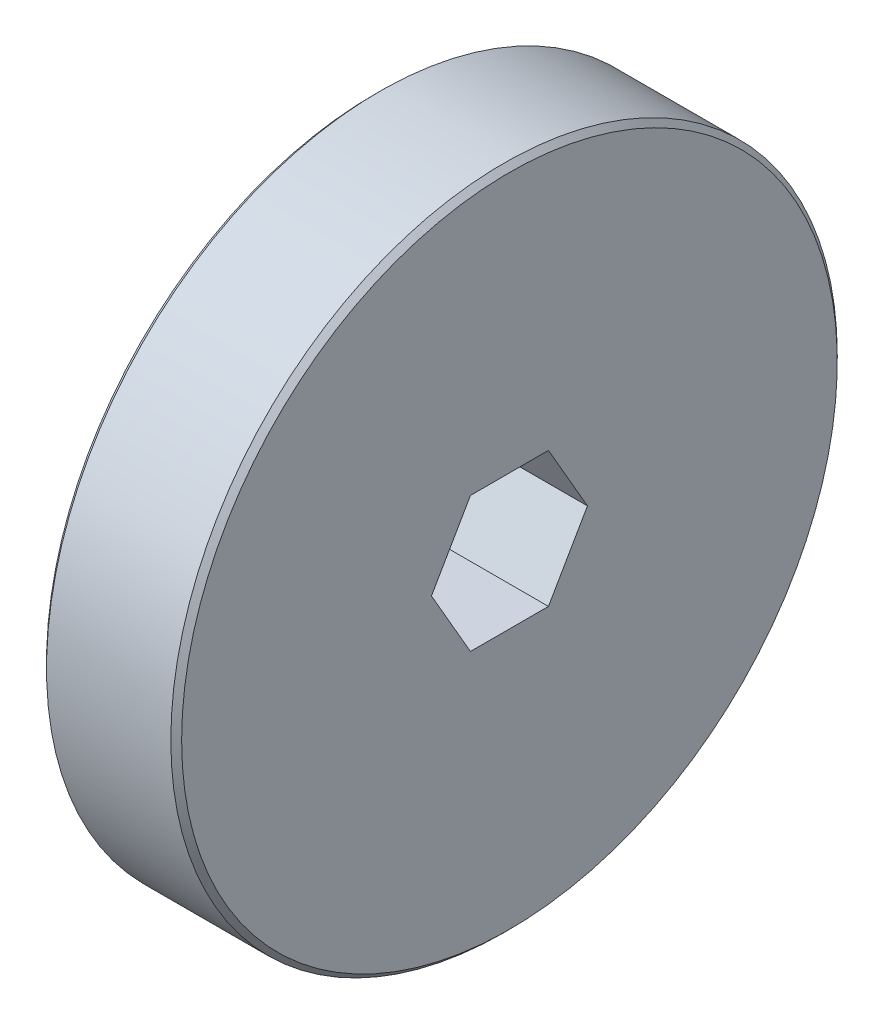
ISO-10303-21;
HEADER;
FILE_DESCRIPTION(('STEP AP214'),'2;1');
FILE_NAME('part.step','',(''),(''),'','','');
FILE_SCHEMA(('AUTOMOTIVE_DESIGN { 1 0 10303 214 1 1 1 1 }'));
ENDSEC;
DATA;
#1=APPLICATION_CONTEXT('core data for automotive mechanical design processes');
#2=APPLICATION_PROTOCOL_DEFINITION('international standard','automotive_design',2000,#1);
#3=PRODUCT_CONTEXT('',#1,'mechanical');
#4=PRODUCT('Part','Part','',(#3));
#5=PRODUCT_RELATED_PRODUCT_CATEGORY('part','',(#4));
#6=PRODUCT_DEFINITION_FORMATION('','',#4);
#7=PRODUCT_DEFINITION_CONTEXT('part definition',#1,'design');
#8=PRODUCT_DEFINITION('design','',#6,#7);
#9=PRODUCT_DEFINITION_SHAPE('','',#8);
#10=(LENGTH_UNIT() NAMED_UNIT(*) SI_UNIT(.MILLI.,.METRE.));
#11=(NAMED_UNIT(*) PLANE_ANGLE_UNIT() SI_UNIT($,.RADIAN.));
#12=(NAMED_UNIT(*) SI_UNIT($,.STERADIAN.) SOLID_ANGLE_UNIT());
#13=UNCERTAINTY_MEASURE_WITH_UNIT(LENGTH_MEASURE(1.E-05),#10,'distance_accuracy_value','');
#14=(GEOMETRIC_REPRESENTATION_CONTEXT(3) GLOBAL_UNCERTAINTY_ASSIGNED_CONTEXT((#13)) GLOBAL_UNIT_ASSIGNED_CONTEXT((#10,
#11,#12)) REPRESENTATION_CONTEXT('',''));
#15=CARTESIAN_POINT('',(0.,0.,0.));
#16=DIRECTION('',(0.,0.,1.));
#17=DIRECTION('',(1.,0.,0.));
#18=AXIS2_PLACEMENT_3D('',#15,#16,#17);
#19=CARTESIAN_POINT('',(814.404078421065,288.105971524835,0.));
#20=DIRECTION('',(1.,0.,0.));
#21=DIRECTION('',(0.,1.,0.));
#22=AXIS2_PLACEMENT_3D('',#19,#20,#21);
#23=TOROIDAL_SURFACE('',#22,8.19149999999989,0.254000000000069);
#24=CARTESIAN_POINT('',(814.658078421065,288.105971524835,0.));
#25=DIRECTION('',(1.,0.,0.));
#26=DIRECTION('',(0.,1.,0.));
#27=AXIS2_PLACEMENT_3D('',#24,#25,#26);
#28=CIRCLE('',#27,8.19150000000002);
#29=CARTESIAN_POINT('',(814.658078421065,296.297471524835,0.));
#30=VERTEX_POINT('',#29);
#31=EDGE_CURVE('E20',#30,#30,#28,.T.);
#32=ORIENTED_EDGE('',*,*,#31,.F.);
#33=EDGE_LOOP('',(#32));
#34=FACE_BOUND('',#33,.T.);
#35=CARTESIAN_POINT('',(814.404078421065,288.105971524835,0.));
#36=DIRECTION('',(1.,0.,0.));
#37=DIRECTION('',(0.,0.,-1.));
#38=AXIS2_PLACEMENT_3D('',#35,#36,#37);
#39=CIRCLE('',#38,7.9375);
#40=CARTESIAN_POINT('',(814.404078421065,288.105971524835,-7.9375));
#41=VERTEX_POINT('',#40);
#42=EDGE_CURVE('E156',#41,#41,#39,.F.);
#43=ORIENTED_EDGE('',*,*,#42,.F.);
#44=EDGE_LOOP('',(#43));
#45=FACE_BOUND('',#44,.T.);
#46=ADVANCED_FACE('F17',(#34,#45),#23,.F.);
#47=CARTESIAN_POINT('',(814.340578421065,288.105971524835,0.));
#48=DIRECTION('',(1.,0.,0.));
#49=DIRECTION('',(0.,0.,-1.));
#50=AXIS2_PLACEMENT_3D('',#47,#48,#49);
#51=CYLINDRICAL_SURFACE('',#50,7.9375);
#52=ORIENTED_EDGE('',*,*,#42,.T.);
#53=EDGE_LOOP('',(#52));
#54=FACE_BOUND('',#53,.T.);
#55=CARTESIAN_POINT('',(814.277078421179,288.105971524835,0.));
#56=DIRECTION('',(1.,0.,0.));
#57=DIRECTION('',(0.,-1.,0.));
#58=AXIS2_PLACEMENT_3D('',#55,#56,#57);
#59=CIRCLE('',#58,7.93749999988602);
#60=CARTESIAN_POINT('',(814.277078421179,280.168471524949,0.));
#61=VERTEX_POINT('',#60);
#62=EDGE_CURVE('E150',#61,#61,#59,.F.);
#63=ORIENTED_EDGE('',*,*,#62,.F.);
#64=EDGE_LOOP('',(#63));
#65=FACE_BOUND('',#64,.T.);
#66=ADVANCED_FACE('F335',(#54,#65),#51,.T.);
#67=CARTESIAN_POINT('',(814.658078421065,303.822221524835,0.));
#68=DIRECTION('',(-1.,0.,0.));
#69=DIRECTION('',(0.,0.,1.));
#70=AXIS2_PLACEMENT_3D('',#67,#68,#69);
#71=PLANE('',#70);
#72=ORIENTED_EDGE('',*,*,#31,.T.);
#73=EDGE_LOOP('',(#72));
#74=FACE_BOUND('',#73,.T.);
#75=CARTESIAN_POINT('',(814.658078420894,288.105971524835,0.));
#76=DIRECTION('',(1.,0.,0.));
#77=DIRECTION('',(0.,0.,-1.));
#78=AXIS2_PLACEMENT_3D('',#75,#76,#77);
#79=CIRCLE('',#78,23.114000000171);
#80=CARTESIAN_POINT('',(814.658078420894,288.105971524835,-23.114000000171));
#81=VERTEX_POINT('',#80);
#82=EDGE_CURVE('E153',#81,#81,#79,.T.);
#83=ORIENTED_EDGE('',*,*,#82,.F.);
#84=EDGE_LOOP('',(#83));
#85=FACE_BOUND('',#84,.T.);
#86=ADVANCED_FACE('F326',(#74,#85),#71,.T.);
#87=CARTESIAN_POINT('',(814.277078421179,288.105971524835,0.));
#88=DIRECTION('',(1.,0.,0.));
#89=DIRECTION('',(0.,0.,-1.));
#90=AXIS2_PLACEMENT_3D('',#87,#88,#89);
#91=CONICAL_SURFACE('',#90,7.93749999988602,0.785398162499982);
#92=ORIENTED_EDGE('',*,*,#62,.T.);
#93=EDGE_LOOP('',(#92));
#94=FACE_BOUND('',#93,.T.);
#95=CARTESIAN_POINT('',(814.023078420951,288.105971524835,0.));
#96=DIRECTION('',(1.,0.,0.));
#97=DIRECTION('',(0.,0.,-1.));
#98=AXIS2_PLACEMENT_3D('',#95,#96,#97);
#99=CIRCLE('',#98,7.68350000011392);
#100=CARTESIAN_POINT('',(814.023078420951,288.105971524835,-7.68350000011392));
#101=VERTEX_POINT('',#100);
#102=EDGE_CURVE('E147',#101,#101,#99,.F.);
#103=ORIENTED_EDGE('',*,*,#102,.F.);
#104=EDGE_LOOP('',(#103));
#105=FACE_BOUND('',#104,.T.);
#106=ADVANCED_FACE('F317',(#94,#105),#91,.T.);
#107=CARTESIAN_POINT('',(815.039078421236,288.105971524835,0.));
#108=DIRECTION('',(1.,0.,0.));
#109=DIRECTION('',(0.,0.,-1.));
#110=AXIS2_PLACEMENT_3D('',#107,#108,#109);
#111=CONICAL_SURFACE('',#110,23.4949999998291,0.785398162500018);
#112=CARTESIAN_POINT('',(815.039078421065,288.105971524835,0.));
#113=DIRECTION('',(1.,0.,0.));
#114=DIRECTION('',(0.,0.,-1.));
#115=AXIS2_PLACEMENT_3D('',#112,#113,#114);
#116=CIRCLE('',#115,23.495);
#117=CARTESIAN_POINT('',(815.039078421065,288.105971524835,-23.495));
#118=VERTEX_POINT('',#117);
#119=EDGE_CURVE('E144',#118,#118,#116,.T.);
#120=ORIENTED_EDGE('',*,*,#119,.F.);
#121=EDGE_LOOP('',(#120));
#122=FACE_BOUND('',#121,.T.);
#123=ORIENTED_EDGE('',*,*,#82,.T.);
#124=EDGE_LOOP('',(#123));
#125=FACE_BOUND('',#124,.T.);
#126=ADVANCED_FACE('F308',(#122,#125),#111,.T.);
#127=CARTESIAN_POINT('',(814.023078421065,292.074721524835,0.));
#128=DIRECTION('',(-1.,0.,0.));
#129=DIRECTION('',(0.,0.,1.));
#130=AXIS2_PLACEMENT_3D('',#127,#128,#129);
#131=PLANE('',#130);
#132=CARTESIAN_POINT('',(814.023078420746,288.105971524835,0.));
#133=DIRECTION('',(-1.,0.,0.));
#134=DIRECTION('',(0.,0.,1.));
#135=AXIS2_PLACEMENT_3D('',#132,#133,#134);
#136=CIRCLE('',#135,5.52449999974425);
#137=CARTESIAN_POINT('',(814.023078420746,288.105971524835,5.52449999974425));
#138=VERTEX_POINT('',#137);
#139=EDGE_CURVE('E116',#138,#138,#136,.F.);
#140=ORIENTED_EDGE('',*,*,#139,.T.);
#141=EDGE_LOOP('',(#140));
#142=FACE_BOUND('',#141,.T.);
#143=ORIENTED_EDGE('',*,*,#102,.T.);
#144=EDGE_LOOP('',(#143));
#145=FACE_BOUND('',#144,.T.);
#146=ADVANCED_FACE('F300',(#142,#145),#131,.T.);
#147=CARTESIAN_POINT('',(819.420578421065,288.105971524835,0.));
#148=DIRECTION('',(1.,0.,0.));
#149=DIRECTION('',(0.,0.,-1.));
#150=AXIS2_PLACEMENT_3D('',#147,#148,#149);
#151=CYLINDRICAL_SURFACE('',#150,23.495);
#152=CARTESIAN_POINT('',(823.802078420894,288.105971524835,0.));
#153=DIRECTION('',(-1.,0.,0.));
#154=DIRECTION('',(0.,-1.,0.));
#155=AXIS2_PLACEMENT_3D('',#152,#153,#154);
#156=CIRCLE('',#155,23.494999999829);
#157=CARTESIAN_POINT('',(823.802078420894,264.610971525006,0.));
#158=VERTEX_POINT('',#157);
#159=EDGE_CURVE('E83',#158,#158,#156,.F.);
#160=ORIENTED_EDGE('',*,*,#159,.F.);
#161=EDGE_LOOP('',(#160));
#162=FACE_BOUND('',#161,.T.);
#163=ORIENTED_EDGE('',*,*,#119,.T.);
#164=EDGE_LOOP('',(#163));
#165=FACE_BOUND('',#164,.T.);
#166=ADVANCED_FACE('F222',(#162,#165),#151,.T.);
#167=CARTESIAN_POINT('',(814.023078420803,288.105971524835,0.));
#168=DIRECTION('',(-1.,0.,0.));
#169=DIRECTION('',(0.,0.,1.));
#170=AXIS2_PLACEMENT_3D('',#167,#168,#169);
#171=CONICAL_SURFACE('',#170,5.5244999996874,0.785398162507615);
#172=ORIENTED_EDGE('',*,*,#139,.F.);
#173=EDGE_LOOP('',(#172));
#174=FACE_BOUND('',#173,.T.);
#175=CARTESIAN_POINT('',(814.048317106639,288.105971524631,5.49926131399009));
#176=CARTESIAN_POINT('',(814.095276713428,288.024623411087,5.45229495868878));
#177=CARTESIAN_POINT('',(814.14080432843,287.942653725722,5.40496973875758));
#178=CARTESIAN_POINT('',(814.228563619718,287.777350388181,5.30953181231453));
#179=CARTESIAN_POINT('',(814.270793501319,287.694016022754,5.26141869400755));
#180=CARTESIAN_POINT('',(814.392296850374,287.440910903982,5.11528838555948));
#181=CARTESIAN_POINT('',(814.465810044093,287.269011053323,5.01604196050402));
#182=CARTESIAN_POINT('',(814.592709375881,286.920203964327,4.81465809377386));
#183=CARTESIAN_POINT('',(814.646163632112,286.743315907082,4.71253172630691));
#184=CARTESIAN_POINT('',(814.707958642217,286.475098749803,4.5576764783527));
#185=CARTESIAN_POINT('',(814.725482238726,286.385324836492,4.50584548533751));
#186=CARTESIAN_POINT('',(814.75400261081,286.205013555752,4.40174271886136));
#187=CARTESIAN_POINT('',(814.765001556536,286.11447645234,4.34947109783016));
#188=CARTESIAN_POINT('',(814.7767347939,285.973970743115,4.2683500887954));
#189=CARTESIAN_POINT('',(814.779861438079,285.924144265866,4.23958275874976));
#190=CARTESIAN_POINT('',(814.784033652413,285.82445460277,4.1820269049065));
#191=CARTESIAN_POINT('',(814.78508035307,285.774591451607,4.15323840113445));
#192=CARTESIAN_POINT('',(814.785073574796,285.599557812022,4.05218268216171));
#193=CARTESIAN_POINT('',(814.778463276719,285.474351418993,3.97989473749762));
#194=CARTESIAN_POINT('',(814.752384357275,285.224898800092,3.83587320086616));
#195=CARTESIAN_POINT('',(814.732906767529,285.100653305109,3.764140030877));
#196=CARTESIAN_POINT('',(814.682008968795,284.853436092213,3.62140910645207));
#197=CARTESIAN_POINT('',(814.650533839888,284.730472944217,3.55041629986063));
#198=CARTESIAN_POINT('',(814.577079766671,284.486910875475,3.40979567391092));
#199=CARTESIAN_POINT('',(814.535096769832,284.366312886285,3.34016839238749));
#200=CARTESIAN_POINT('',(814.427994134356,284.091302146559,3.18139086777519));
#201=CARTESIAN_POINT('',(814.359724319717,283.937811006125,3.09277271652804));
#202=CARTESIAN_POINT('',(814.248663318791,283.711659062559,2.96220383103236));
#203=CARTESIAN_POINT('',(814.210393068711,283.637284002713,2.9192633702096));
#204=CARTESIAN_POINT('',(814.131237316078,283.489598498439,2.83399710456165));
#205=CARTESIAN_POINT('',(814.090352248931,283.416287879247,2.79167119883672));
#206=CARTESIAN_POINT('',(814.048317106608,283.343471525015,2.74963065711948));
#207=B_SPLINE_CURVE_WITH_KNOTS('',3,(#175,#176,#177,#178,#179,#180,#181,#182,#183,#184,#185,
#186,#187,#188,#189,#190,#191,#192,#193,#194,#195,#196,#197,#198,#199,#200,#201,#202,#203,#204,
#205,#206),.UNSPECIFIED.,.F.,.F.,(4,2,2,2,2,2,2,2,2,2,2,2,2,2,2,4),(0.,0.315033356545603,
0.630236981876394,1.26441953450874,1.89642854621824,2.21165534619422,2.52677724038584,
2.69960160988732,2.87233201930486,3.30585139200733,3.73967324283356,4.17550527965052,
4.61150566186299,5.18066674352936,5.46270108821175,5.74468859165306),.UNSPECIFIED.);
#208=CARTESIAN_POINT('',(814.04831710661,288.105971524835,5.49926131392526));
#209=VERTEX_POINT('',#208);
#210=CARTESIAN_POINT('',(814.04831710661,283.343471524927,2.74963065696263));
#211=VERTEX_POINT('',#210);
#212=EDGE_CURVE('E90',#209,#211,#207,.T.);
#213=ORIENTED_EDGE('',*,*,#212,.T.);
#214=CARTESIAN_POINT('',(814.048317106639,283.343471524769,2.74963065681831));
#215=CARTESIAN_POINT('',(814.095276713428,283.343471524811,2.6556979462883));
#216=CARTESIAN_POINT('',(814.14080432843,283.343471524829,2.56104750645672));
#217=CARTESIAN_POINT('',(814.228563619718,283.343471524842,2.37017165359389));
#218=CARTESIAN_POINT('',(814.270793501319,283.343471524838,2.27394541697236));
#219=CARTESIAN_POINT('',(814.392296850374,283.343471524831,1.98168480006385));
#220=CARTESIAN_POINT('',(814.465810044093,283.343471524834,1.78319194995864));
#221=CARTESIAN_POINT('',(814.592709375881,283.343471524837,1.38042421650349));
#222=CARTESIAN_POINT('',(814.646163632112,283.343471524837,1.1761714815691));
#223=CARTESIAN_POINT('',(814.707958642217,283.343471524835,0.866460985657548));
#224=CARTESIAN_POINT('',(814.725482238726,283.343471524834,0.762798999625741));
#225=CARTESIAN_POINT('',(814.75400261081,283.343471524837,0.5545934666784));
#226=CARTESIAN_POINT('',(814.765001556536,283.343471524841,0.45005022462239));
#227=CARTESIAN_POINT('',(814.7767347939,283.343471524833,0.287808206539142));
#228=CARTESIAN_POINT('',(814.779861438079,283.343471524827,0.230273546438418));
#229=CARTESIAN_POINT('',(814.784033652413,283.343471524844,0.115161838780523));
#230=CARTESIAN_POINT('',(814.78508035307,283.343471524866,0.0575848312744657));
#231=CARTESIAN_POINT('',(814.785073574796,283.343471524902,-0.1445266066089));
#232=CARTESIAN_POINT('',(814.778463276719,283.343471524853,-0.289102496020808));
#233=CARTESIAN_POINT('',(814.752384357275,283.343471524818,-0.5771455693451));
#234=CARTESIAN_POINT('',(814.732906767529,283.343471524831,-0.720611909301002));
#235=CARTESIAN_POINT('',(814.682008968795,283.34347152484,-1.00607375813436));
#236=CARTESIAN_POINT('',(814.650533839888,283.343471524837,-1.14805937132329));
#237=CARTESIAN_POINT('',(814.577079766671,283.343471524834,-1.4293006232272));
#238=CARTESIAN_POINT('',(814.535096769832,283.343471524835,-1.56855518627248));
#239=CARTESIAN_POINT('',(814.427994134356,283.343471524836,-1.88611023549555));
#240=CARTESIAN_POINT('',(814.359724319717,283.343471524836,-2.06334653799052));
#241=CARTESIAN_POINT('',(814.248663318791,283.343471524835,-2.32448430898219));
#242=CARTESIAN_POINT('',(814.210393068711,283.343471524835,-2.4103652306277));
#243=CARTESIAN_POINT('',(814.131237316078,283.343471524835,-2.58089776192351));
#244=CARTESIAN_POINT('',(814.090352248931,283.343471524835,-2.6655495733733));
#245=CARTESIAN_POINT('',(814.048317106608,283.343471524835,-2.74963065680782));
#246=B_SPLINE_CURVE_WITH_KNOTS('',3,(#214,#215,#216,#217,#218,#219,#220,#221,#222,#223,#224,
#225,#226,#227,#228,#229,#230,#231,#232,#233,#234,#235,#236,#237,#238,#239,#240,#241,#242,#243,
#244,#245),.UNSPECIFIED.,.F.,.F.,(4,2,2,2,2,2,2,2,2,2,2,2,2,2,2,4),(0.,0.315033356545621,
0.630236981876475,1.26441953450874,1.89642854621826,2.21165534619423,2.52677724038585,
2.69960160988731,2.87233201930483,3.30585139200723,3.73967324283357,4.17550527965054,
4.61150566186297,5.18066674352941,5.46270108821183,5.74468859165302),.UNSPECIFIED.);
#247=CARTESIAN_POINT('',(814.04831710661,283.343471524927,-2.74963065696263));
#248=VERTEX_POINT('',#247);
#249=EDGE_CURVE('E102',#211,#248,#246,.T.);
#250=ORIENTED_EDGE('',*,*,#249,.T.);
#251=CARTESIAN_POINT('',(814.048317106639,283.343471524973,-2.74963065717178));
#252=CARTESIAN_POINT('',(814.095276713428,283.424819638559,-2.79659701240047));
#253=CARTESIAN_POINT('',(814.14080432843,283.506789323942,-2.84392223230084));
#254=CARTESIAN_POINT('',(814.228563619718,283.672092661497,-2.93936015872059));
#255=CARTESIAN_POINT('',(814.270793501319,283.755427026919,-2.98747327703513));
#256=CARTESIAN_POINT('',(814.392296850374,284.008532145684,-3.13360358549558));
#257=CARTESIAN_POINT('',(814.465810044093,284.180431996346,-3.23285001054535));
#258=CARTESIAN_POINT('',(814.592709375881,284.529239085345,-3.43423387727036));
#259=CARTESIAN_POINT('',(814.646163632112,284.70612714259,-3.53636024473781));
#260=CARTESIAN_POINT('',(814.707958642217,284.974344299868,-3.69121549269513));
#261=CARTESIAN_POINT('',(814.725482238726,285.064118213177,-3.74304648571174));
#262=CARTESIAN_POINT('',(814.75400261081,285.24442949392,-3.84714925218294));
#263=CARTESIAN_POINT('',(814.765001556536,285.334966597336,-3.89942087320776));
#264=CARTESIAN_POINT('',(814.7767347939,285.475472306553,-3.98054188225626));
#265=CARTESIAN_POINT('',(814.779861438079,285.525298783796,-4.00930921231136));
#266=CARTESIAN_POINT('',(814.784033652413,285.624988446909,-4.066865066126));
#267=CARTESIAN_POINT('',(814.78508035307,285.674851598094,-4.09565356985999));
#268=CARTESIAN_POINT('',(814.785073574796,285.849885237714,-4.19670928877062));
#269=CARTESIAN_POINT('',(814.778463276719,285.975091630696,-4.26899723351845));
#270=CARTESIAN_POINT('',(814.752384357275,286.224544249561,-4.4130187702113));
#271=CARTESIAN_POINT('',(814.732906767529,286.348789744557,-4.48475194017803));
#272=CARTESIAN_POINT('',(814.682008968795,286.596006957463,-4.62748286458644));
#273=CARTESIAN_POINT('',(814.650533839888,286.718970105455,-4.69847567118392));
#274=CARTESIAN_POINT('',(814.577079766671,286.962532174195,-4.83909629713811));
#275=CARTESIAN_POINT('',(814.535096769832,287.083130163385,-4.90872357865997));
#276=CARTESIAN_POINT('',(814.427994134356,287.358140903113,-5.06750110327075));
#277=CARTESIAN_POINT('',(814.359724319717,287.511632043546,-5.1561192545186));
#278=CARTESIAN_POINT('',(814.248663318791,287.737783987112,-5.28668814001456));
#279=CARTESIAN_POINT('',(814.210393068711,287.812159046958,-5.32962860083729));
#280=CARTESIAN_POINT('',(814.131237316078,287.959844551232,-5.41489486648514));
#281=CARTESIAN_POINT('',(814.090352248931,288.033155170423,-5.45722077221001));
#282=CARTESIAN_POINT('',(814.048317106608,288.105971524656,-5.49926131392731));
#283=B_SPLINE_CURVE_WITH_KNOTS('',3,(#251,#252,#253,#254,#255,#256,#257,#258,#259,#260,#261,
#262,#263,#264,#265,#266,#267,#268,#269,#270,#271,#272,#273,#274,#275,#276,#277,#278,#279,#280,
#281,#282),.UNSPECIFIED.,.F.,.F.,(4,2,2,2,2,2,2,2,2,2,2,2,2,2,2,4),(0.,0.315033356545598,
0.630236981876397,1.26441953450874,1.89642854621825,2.21165534619422,2.52677724038584,
2.69960160988739,2.87233201930483,3.30585139200726,3.73967324283356,4.17550527965057,
4.611505661863,5.18066674352947,5.46270108821186,5.74468859165306),.UNSPECIFIED.);
#284=CARTESIAN_POINT('',(814.04831710661,288.105971524835,-5.49926131392526));
#285=VERTEX_POINT('',#284);
#286=EDGE_CURVE('E107',#248,#285,#283,.T.);
#287=ORIENTED_EDGE('',*,*,#286,.T.);
#288=CARTESIAN_POINT('',(814.048317106639,288.105971525039,-5.49926131399009));
#289=CARTESIAN_POINT('',(814.095276713428,288.187319638584,-5.45229495868879));
#290=CARTESIAN_POINT('',(814.14080432843,288.269289323948,-5.4049697387576));
#291=CARTESIAN_POINT('',(814.228563619718,288.43459266149,-5.30953181231454));
#292=CARTESIAN_POINT('',(814.270793501319,288.517927026917,-5.26141869400754));
#293=CARTESIAN_POINT('',(814.392296850374,288.771032145689,-5.11528838555945));
#294=CARTESIAN_POINT('',(814.465810044093,288.942931996348,-5.01604196050401));
#295=CARTESIAN_POINT('',(814.592709375881,289.291739085343,-4.81465809377385));
#296=CARTESIAN_POINT('',(814.646163632112,289.468627142589,-4.71253172630691));
#297=CARTESIAN_POINT('',(814.707958642217,289.736844299868,-4.55767647835269));
#298=CARTESIAN_POINT('',(814.725482238726,289.826618213179,-4.50584548533751));
#299=CARTESIAN_POINT('',(814.75400261081,290.006929493918,-4.40174271886136));
#300=CARTESIAN_POINT('',(814.765001556536,290.097466597331,-4.34947109783016));
#301=CARTESIAN_POINT('',(814.7767347939,290.237972306556,-4.2683500887954));
#302=CARTESIAN_POINT('',(814.779861438079,290.287798783804,-4.23958275874976));
#303=CARTESIAN_POINT('',(814.784033652413,290.387488446901,-4.1820269049065));
#304=CARTESIAN_POINT('',(814.78508035307,290.437351598064,-4.15323840113445));
#305=CARTESIAN_POINT('',(814.785073574796,290.612385237648,-4.05218268216172));
#306=CARTESIAN_POINT('',(814.778463276719,290.737591630678,-3.97989473749765));
#307=CARTESIAN_POINT('',(814.752384357275,290.987044249579,-3.8358732008662));
#308=CARTESIAN_POINT('',(814.732906767529,291.111289744562,-3.76414003087702));
#309=CARTESIAN_POINT('',(814.682008968795,291.358506957458,-3.62140910645206));
#310=CARTESIAN_POINT('',(814.650533839888,291.481470105454,-3.55041629986061));
#311=CARTESIAN_POINT('',(814.577079766671,291.725032174196,-3.4097956739109));
#312=CARTESIAN_POINT('',(814.535096769832,291.845630163385,-3.34016839238747));
#313=CARTESIAN_POINT('',(814.427994134356,292.120640903112,-3.18139086777517));
#314=CARTESIAN_POINT('',(814.359724319717,292.274132043546,-3.09277271652801));
#315=CARTESIAN_POINT('',(814.248663318791,292.500283987112,-2.96220383103231));
#316=CARTESIAN_POINT('',(814.210393068711,292.574659046958,-2.91926337020954));
#317=CARTESIAN_POINT('',(814.131237316078,292.722344551232,-2.8339971045616));
#318=CARTESIAN_POINT('',(814.090352248931,292.795655170424,-2.79167119883668));
#319=CARTESIAN_POINT('',(814.048317106608,292.868471524655,-2.74963065711946));
#320=B_SPLINE_CURVE_WITH_KNOTS('',3,(#288,#289,#290,#291,#292,#293,#294,#295,#296,#297,#298,
#299,#300,#301,#302,#303,#304,#305,#306,#307,#308,#309,#310,#311,#312,#313,#314,#315,#316,#317,
#318,#319),.UNSPECIFIED.,.F.,.F.,(4,2,2,2,2,2,2,2,2,2,2,2,2,2,2,4),(0.,0.315033356545594,
0.63023698187645,1.26441953450874,1.89642854621824,2.21165534619422,2.52677724038584,
2.69960160988732,2.87233201930486,3.30585139200726,3.73967324283361,4.17550527965063,
4.61150566186299,5.18066674352947,5.46270108821191,5.74468859165312),.UNSPECIFIED.);
#321=CARTESIAN_POINT('',(814.04831710661,292.868471524744,-2.74963065696262));
#322=VERTEX_POINT('',#321);
#323=EDGE_CURVE('E80',#285,#322,#320,.T.);
#324=ORIENTED_EDGE('',*,*,#323,.T.);
#325=CARTESIAN_POINT('',(814.048317106639,292.868471524902,-2.74963065681832));
#326=CARTESIAN_POINT('',(814.095276713428,292.86847152486,-2.65569794628829));
#327=CARTESIAN_POINT('',(814.14080432843,292.868471524842,-2.56104750645671));
#328=CARTESIAN_POINT('',(814.228563619718,292.868471524829,-2.37017165359389));
#329=CARTESIAN_POINT('',(814.270793501319,292.868471524833,-2.27394541697235));
#330=CARTESIAN_POINT('',(814.392296850374,292.86847152484,-1.98168480006386));
#331=CARTESIAN_POINT('',(814.465810044093,292.868471524837,-1.78319194995865));
#332=CARTESIAN_POINT('',(814.592709375881,292.868471524834,-1.38042421650351));
#333=CARTESIAN_POINT('',(814.646163632112,292.868471524834,-1.17617148156913));
#334=CARTESIAN_POINT('',(814.707958642217,292.868471524836,-0.86646098565758));
#335=CARTESIAN_POINT('',(814.725482238726,292.868471524837,-0.762798999625775));
#336=CARTESIAN_POINT('',(814.75400261081,292.868471524834,-0.55459346667844));
#337=CARTESIAN_POINT('',(814.765001556536,292.86847152483,-0.450050224622433));
#338=CARTESIAN_POINT('',(814.7767347939,292.868471524838,-0.28780820653918));
#339=CARTESIAN_POINT('',(814.779861438079,292.868471524844,-0.230273546438448));
#340=CARTESIAN_POINT('',(814.784033652413,292.868471524827,-0.115161838780538));
#341=CARTESIAN_POINT('',(814.78508035307,292.868471524805,-0.057584831274475));
#342=CARTESIAN_POINT('',(814.785073574796,292.868471524769,0.1445266066089));
#343=CARTESIAN_POINT('',(814.778463276719,292.868471524818,0.289102496020811));
#344=CARTESIAN_POINT('',(814.752384357275,292.868471524853,0.577145569345103));
#345=CARTESIAN_POINT('',(814.732906767529,292.86847152484,0.720611909301002));
#346=CARTESIAN_POINT('',(814.682008968795,292.868471524831,1.00607375813436));
#347=CARTESIAN_POINT('',(814.650533839888,292.868471524834,1.14805937132329));
#348=CARTESIAN_POINT('',(814.577079766671,292.868471524837,1.42930062322719));
#349=CARTESIAN_POINT('',(814.535096769832,292.868471524836,1.56855518627248));
#350=CARTESIAN_POINT('',(814.427994134356,292.868471524835,1.88611023549554));
#351=CARTESIAN_POINT('',(814.359724319717,292.868471524835,2.06334653799052));
#352=CARTESIAN_POINT('',(814.248663318791,292.868471524835,2.32448430898218));
#353=CARTESIAN_POINT('',(814.210393068711,292.868471524835,2.41036523062769));
#354=CARTESIAN_POINT('',(814.131237316078,292.868471524835,2.5808977619235));
#355=CARTESIAN_POINT('',(814.090352248931,292.868471524835,2.66554957337328));
#356=CARTESIAN_POINT('',(814.048317106608,292.868471524835,2.74963065680781));
#357=B_SPLINE_CURVE_WITH_KNOTS('',3,(#325,#326,#327,#328,#329,#330,#331,#332,#333,#334,#335,
#336,#337,#338,#339,#340,#341,#342,#343,#344,#345,#346,#347,#348,#349,#350,#351,#352,#353,#354,
#355,#356),.UNSPECIFIED.,.F.,.F.,(4,2,2,2,2,2,2,2,2,2,2,2,2,2,2,4),(0.,0.315033356545585,
0.630236981876435,1.26441953450868,1.89642854621819,2.21165534619416,2.52677724038576,
2.69960160988726,2.87233201930479,3.3058513920072,3.73967324283353,4.1755052796505,
4.61150566186293,5.18066674352937,5.46270108821178,5.74468859165297),.UNSPECIFIED.);
#358=CARTESIAN_POINT('',(814.048317106557,292.868471524835,2.74963065690967));
#359=VERTEX_POINT('',#358);
#360=EDGE_CURVE('E77',#322,#359,#357,.T.);
#361=ORIENTED_EDGE('',*,*,#360,.T.);
#362=CARTESIAN_POINT('',(814.048317106639,292.868471524698,2.74963065717179));
#363=CARTESIAN_POINT('',(814.095276713428,292.787123411112,2.79659701240048));
#364=CARTESIAN_POINT('',(814.14080432843,292.705153725729,2.84392223230085));
#365=CARTESIAN_POINT('',(814.228563619718,292.539850388174,2.93936015872062));
#366=CARTESIAN_POINT('',(814.270793501319,292.456516022752,2.98747327703516));
#367=CARTESIAN_POINT('',(814.392296850374,292.203410903987,3.13360358549559));
#368=CARTESIAN_POINT('',(814.465810044093,292.031511053324,3.23285001054535));
#369=CARTESIAN_POINT('',(814.592709375881,291.682703964326,3.43423387727033));
#370=CARTESIAN_POINT('',(814.646163632112,291.505815907081,3.53636024473777));
#371=CARTESIAN_POINT('',(814.707958642217,291.237598749803,3.69121549269509));
#372=CARTESIAN_POINT('',(814.725482238726,291.147824836493,3.74304648571171));
#373=CARTESIAN_POINT('',(814.75400261081,290.967513555751,3.84714925218291));
#374=CARTESIAN_POINT('',(814.765001556536,290.876976452335,3.89942087320774));
#375=CARTESIAN_POINT('',(814.7767347939,290.736470743117,3.98054188225621));
#376=CARTESIAN_POINT('',(814.779861438079,290.686644265875,4.00930921231128));
#377=CARTESIAN_POINT('',(814.784033652413,290.586954602762,4.06686506612593));
#378=CARTESIAN_POINT('',(814.78508035307,290.537091451577,4.09565356985996));
#379=CARTESIAN_POINT('',(814.785073574796,290.362057811956,4.19670928877063));
#380=CARTESIAN_POINT('',(814.778463276719,290.236851418975,4.26899723351846));
#381=CARTESIAN_POINT('',(814.752384357275,289.98739880011,4.4130187702113));
#382=CARTESIAN_POINT('',(814.732906767529,289.863153305114,4.48475194017803));
#383=CARTESIAN_POINT('',(814.682008968795,289.615936092208,4.62748286458644));
#384=CARTESIAN_POINT('',(814.650533839888,289.492972944216,4.69847567118392));
#385=CARTESIAN_POINT('',(814.577079766671,289.249410875476,4.83909629713811));
#386=CARTESIAN_POINT('',(814.535096769832,289.128812886286,4.90872357865997));
#387=CARTESIAN_POINT('',(814.427994134356,288.853802146558,5.06750110327073));
#388=CARTESIAN_POINT('',(814.359724319717,288.700311006125,5.15611925451855));
#389=CARTESIAN_POINT('',(814.248663318791,288.474159062559,5.28668814001449));
#390=CARTESIAN_POINT('',(814.210393068711,288.399784002713,5.32962860083722));
#391=CARTESIAN_POINT('',(814.131237316078,288.252098498439,5.41489486648509));
#392=CARTESIAN_POINT('',(814.090352248931,288.178787879247,5.45722077220998));
#393=CARTESIAN_POINT('',(814.048317106608,288.105971525015,5.49926131392731));
#394=B_SPLINE_CURVE_WITH_KNOTS('',3,(#362,#363,#364,#365,#366,#367,#368,#369,#370,#371,#372,
#373,#374,#375,#376,#377,#378,#379,#380,#381,#382,#383,#384,#385,#386,#387,#388,#389,#390,#391,
#392,#393),.UNSPECIFIED.,.F.,.F.,(4,2,2,2,2,2,2,2,2,2,2,2,2,2,2,4),(0.,0.315033356545693,
0.630236981876492,1.26441953450872,1.89642854621819,2.21165534619419,2.52677724038581,
2.69960160988722,2.87233201930487,3.3058513920073,3.7396732428336,4.1755052796506,
4.61150566186303,5.18066674352934,5.46270108821178,5.74468859165309),.UNSPECIFIED.);
#395=EDGE_CURVE('E67',#359,#209,#394,.T.);
#396=ORIENTED_EDGE('',*,*,#395,.T.);
#397=EDGE_LOOP('',(#213,#250,#287,#324,#361,#396));
#398=FACE_BOUND('',#397,.T.);
#399=ADVANCED_FACE('F78',(#174,#398),#171,.F.);
#400=CARTESIAN_POINT('',(823.802078420894,288.105971524835,0.));
#401=DIRECTION('',(-1.,0.,0.));
#402=DIRECTION('',(0.,0.,1.));
#403=AXIS2_PLACEMENT_3D('',#400,#401,#402);
#404=CONICAL_SURFACE('',#403,23.494999999829,0.785398162500164);
#405=CARTESIAN_POINT('',(824.183078421236,288.105971524835,0.));
#406=DIRECTION('',(-1.,0.,0.));
#407=DIRECTION('',(0.,0.,1.));
#408=AXIS2_PLACEMENT_3D('',#405,#406,#407);
#409=CIRCLE('',#408,23.1140000001709);
#410=CARTESIAN_POINT('',(824.183078421236,288.105971524835,23.1140000001709));
#411=VERTEX_POINT('',#410);
#412=EDGE_CURVE('E128',#411,#411,#409,.F.);
#413=ORIENTED_EDGE('',*,*,#412,.F.);
#414=EDGE_LOOP('',(#413));
#415=FACE_BOUND('',#414,.T.);
#416=ORIENTED_EDGE('',*,*,#159,.T.);
#417=EDGE_LOOP('',(#416));
#418=FACE_BOUND('',#417,.T.);
#419=ADVANCED_FACE('F215',(#415,#418),#404,.T.);
#420=CARTESIAN_POINT('',(814.023078421065,292.868471524835,2.7496306570156));
#421=DIRECTION('',(0.,1.,0.));
#422=DIRECTION('',(0.,0.,1.));
#423=AXIS2_PLACEMENT_3D('',#420,#421,#422);
#424=PLANE('',#423);
#425=DIRECTION('',(1.,0.,0.));
#426=VECTOR('',#425,1.);
#427=CARTESIAN_POINT('',(814.023078421065,292.868471524835,2.7496306570156));
#428=LINE('',#427,#426);
#429=CARTESIAN_POINT('',(824.183078421065,292.868471524835,2.7496306570156));
#430=VERTEX_POINT('',#429);
#431=EDGE_CURVE('E71',#430,#359,#428,.F.);
#432=ORIENTED_EDGE('',*,*,#431,.T.);
#433=ORIENTED_EDGE('',*,*,#360,.F.);
#434=DIRECTION('',(1.,0.,0.));
#435=VECTOR('',#434,1.);
#436=CARTESIAN_POINT('',(814.023078421065,292.868471524835,-2.7496306570156));
#437=LINE('',#436,#435);
#438=CARTESIAN_POINT('',(824.183078421065,292.868471524835,-2.7496306570156));
#439=VERTEX_POINT('',#438);
#440=EDGE_CURVE('E110',#322,#439,#437,.T.);
#441=ORIENTED_EDGE('',*,*,#440,.T.);
#442=DIRECTION('',(0.,0.,-1.));
#443=VECTOR('',#442,1.);
#444=CARTESIAN_POINT('',(824.183078421065,292.868471524835,0.));
#445=LINE('',#444,#443);
#446=EDGE_CURVE('E87',#430,#439,#445,.T.);
#447=ORIENTED_EDGE('',*,*,#446,.F.);
#448=EDGE_LOOP('',(#432,#433,#441,#447));
#449=FACE_BOUND('',#448,.T.);
#450=ADVANCED_FACE('F85',(#449),#424,.F.);
#451=CARTESIAN_POINT('',(814.023078421065,292.868471524835,-2.7496306570156));
#452=DIRECTION('',(0.,0.5,-0.866025403784439));
#453=DIRECTION('',(0.,0.866025403784439,0.5));
#454=AXIS2_PLACEMENT_3D('',#451,#452,#453);
#455=PLANE('',#454);
#456=ORIENTED_EDGE('',*,*,#440,.F.);
#457=ORIENTED_EDGE('',*,*,#323,.F.);
#458=DIRECTION('',(1.,0.,0.));
#459=VECTOR('',#458,1.);
#460=CARTESIAN_POINT('',(814.023078421065,288.105971524835,-5.49926131403119));
#461=LINE('',#460,#459);
#462=CARTESIAN_POINT('',(824.183078421065,288.105971524835,-5.49926131403119));
#463=VERTEX_POINT('',#462);
#464=EDGE_CURVE('E105',#285,#463,#461,.T.);
#465=ORIENTED_EDGE('',*,*,#464,.T.);
#466=DIRECTION('',(0.,-0.866025403784438,-0.5));
#467=VECTOR('',#466,1.);
#468=CARTESIAN_POINT('',(824.183078421065,292.868471524835,-2.7496306570156));
#469=LINE('',#468,#467);
#470=EDGE_CURVE('E127',#439,#463,#469,.T.);
#471=ORIENTED_EDGE('',*,*,#470,.F.);
#472=EDGE_LOOP('',(#456,#457,#465,#471));
#473=FACE_BOUND('',#472,.T.);
#474=ADVANCED_FACE('F209',(#473),#455,.F.);
#475=CARTESIAN_POINT('',(814.023078421065,288.105971524835,-5.49926131403119));
#476=DIRECTION('',(0.,-0.5,-0.866025403784438));
#477=DIRECTION('',(0.,0.866025403784438,-0.5));
#478=AXIS2_PLACEMENT_3D('',#475,#476,#477);
#479=PLANE('',#478);
#480=ORIENTED_EDGE('',*,*,#464,.F.);
#481=ORIENTED_EDGE('',*,*,#286,.F.);
#482=DIRECTION('',(1.,0.,0.));
#483=VECTOR('',#482,1.);
#484=CARTESIAN_POINT('',(814.023078421065,283.343471524835,-2.7496306570156));
#485=LINE('',#484,#483);
#486=CARTESIAN_POINT('',(824.183078421065,283.343471524835,-2.7496306570156));
#487=VERTEX_POINT('',#486);
#488=EDGE_CURVE('E100',#248,#487,#485,.T.);
#489=ORIENTED_EDGE('',*,*,#488,.T.);
#490=DIRECTION('',(0.,-0.866025403784438,0.5));
#491=VECTOR('',#490,1.);
#492=CARTESIAN_POINT('',(824.183078421065,288.105971524835,-5.49926131403119));
#493=LINE('',#492,#491);
#494=EDGE_CURVE('E133',#463,#487,#493,.T.);
#495=ORIENTED_EDGE('',*,*,#494,.F.);
#496=EDGE_LOOP('',(#480,#481,#489,#495));
#497=FACE_BOUND('',#496,.T.);
#498=ADVANCED_FACE('F188',(#497),#479,.F.);
#499=CARTESIAN_POINT('',(814.023078421065,283.343471524835,-2.7496306570156));
#500=DIRECTION('',(0.,-1.,0.));
#501=DIRECTION('',(0.,0.,-1.));
#502=AXIS2_PLACEMENT_3D('',#499,#500,#501);
#503=PLANE('',#502);
#504=ORIENTED_EDGE('',*,*,#488,.F.);
#505=ORIENTED_EDGE('',*,*,#249,.F.);
#506=DIRECTION('',(1.,0.,0.));
#507=VECTOR('',#506,1.);
#508=CARTESIAN_POINT('',(814.023078421065,283.343471524835,2.7496306570156));
#509=LINE('',#508,#507);
#510=CARTESIAN_POINT('',(824.183078421065,283.343471524835,2.7496306570156));
#511=VERTEX_POINT('',#510);
#512=EDGE_CURVE('E88',#211,#511,#509,.T.);
#513=ORIENTED_EDGE('',*,*,#512,.T.);
#514=DIRECTION('',(0.,0.,-1.));
#515=VECTOR('',#514,1.);
#516=CARTESIAN_POINT('',(824.183078421065,283.343471524835,0.));
#517=LINE('',#516,#515);
#518=EDGE_CURVE('E123',#487,#511,#517,.F.);
#519=ORIENTED_EDGE('',*,*,#518,.F.);
#520=EDGE_LOOP('',(#504,#505,#513,#519));
#521=FACE_BOUND('',#520,.T.);
#522=ADVANCED_FACE('F184',(#521),#503,.F.);
#523=CARTESIAN_POINT('',(814.023078421065,283.343471524835,2.7496306570156));
#524=DIRECTION('',(0.,-0.5,0.866025403784439));
#525=DIRECTION('',(0.,-0.866025403784439,-0.5));
#526=AXIS2_PLACEMENT_3D('',#523,#524,#525);
#527=PLANE('',#526);
#528=ORIENTED_EDGE('',*,*,#512,.F.);
#529=ORIENTED_EDGE('',*,*,#212,.F.);
#530=DIRECTION('',(1.,0.,0.));
#531=VECTOR('',#530,1.);
#532=CARTESIAN_POINT('',(814.023078421065,288.105971524835,5.49926131403119));
#533=LINE('',#532,#531);
#534=CARTESIAN_POINT('',(824.183078421065,288.105971524835,5.49926131403119));
#535=VERTEX_POINT('',#534);
#536=EDGE_CURVE('E35',#209,#535,#533,.T.);
#537=ORIENTED_EDGE('',*,*,#536,.T.);
#538=DIRECTION('',(0.,0.866025403784438,0.5));
#539=VECTOR('',#538,1.);
#540=CARTESIAN_POINT('',(824.183078421065,283.343471524835,2.7496306570156));
#541=LINE('',#540,#539);
#542=EDGE_CURVE('E26',#511,#535,#541,.T.);
#543=ORIENTED_EDGE('',*,*,#542,.F.);
#544=EDGE_LOOP('',(#528,#529,#537,#543));
#545=FACE_BOUND('',#544,.T.);
#546=ADVANCED_FACE('F180',(#545),#527,.F.);
#547=CARTESIAN_POINT('',(814.023078421065,288.105971524835,5.49926131403119));
#548=DIRECTION('',(0.,0.5,0.866025403784439));
#549=DIRECTION('',(0.,-0.866025403784439,0.5));
#550=AXIS2_PLACEMENT_3D('',#547,#548,#549);
#551=PLANE('',#550);
#552=ORIENTED_EDGE('',*,*,#536,.F.);
#553=ORIENTED_EDGE('',*,*,#395,.F.);
#554=ORIENTED_EDGE('',*,*,#431,.F.);
#555=DIRECTION('',(0.,0.866025403784438,-0.5));
#556=VECTOR('',#555,1.);
#557=CARTESIAN_POINT('',(824.183078421065,288.105971524835,5.49926131403119));
#558=LINE('',#557,#556);
#559=EDGE_CURVE('E11',#535,#430,#558,.T.);
#560=ORIENTED_EDGE('',*,*,#559,.F.);
#561=EDGE_LOOP('',(#552,#553,#554,#560));
#562=FACE_BOUND('',#561,.T.);
#563=ADVANCED_FACE('F69',(#562),#551,.F.);
#564=CARTESIAN_POINT('',(824.183078421065,299.853471524835,0.));
#565=DIRECTION('',(1.,0.,0.));
#566=DIRECTION('',(0.,0.,-1.));
#567=AXIS2_PLACEMENT_3D('',#564,#565,#566);
#568=PLANE('',#567);
#569=ORIENTED_EDGE('',*,*,#542,.T.);
#570=ORIENTED_EDGE('',*,*,#559,.T.);
#571=ORIENTED_EDGE('',*,*,#446,.T.);
#572=ORIENTED_EDGE('',*,*,#470,.T.);
#573=ORIENTED_EDGE('',*,*,#494,.T.);
#574=ORIENTED_EDGE('',*,*,#518,.T.);
#575=EDGE_LOOP('',(#569,#570,#571,#572,#573,#574));
#576=FACE_BOUND('',#575,.T.);
#577=ORIENTED_EDGE('',*,*,#412,.T.);
#578=EDGE_LOOP('',(#577));
#579=FACE_BOUND('',#578,.T.);
#580=ADVANCED_FACE('F179',(#576,#579),#568,.T.);
#581=CLOSED_SHELL('',(#46,#66,#86,#106,#126,#146,#166,#399,#419,#450,#474,#498,#522,#546,#563,#580));
#582=MANIFOLD_SOLID_BREP('B1',#581);
#583=ADVANCED_BREP_SHAPE_REPRESENTATION('',(#18,#582),#14);
#584=SHAPE_DEFINITION_REPRESENTATION(#9,#583);
ENDSEC;
END-ISO-10303-21;
